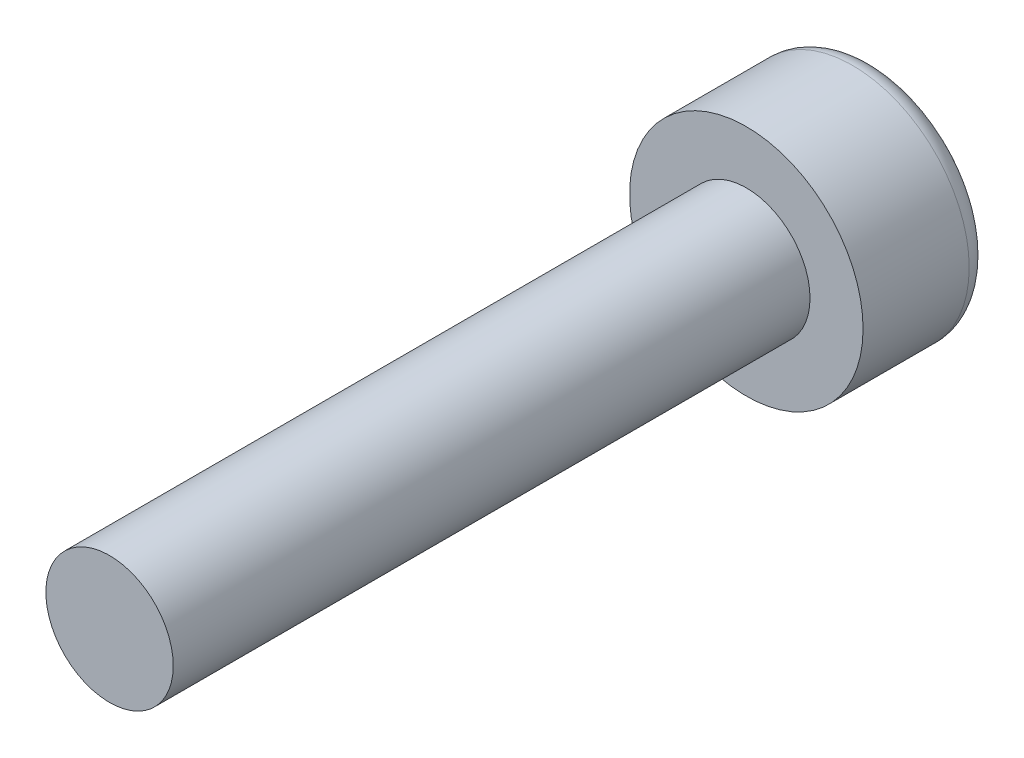
ISO-10303-21;
HEADER;
FILE_DESCRIPTION(('STEP AP214'),'2;1');
FILE_NAME('part.step','',(''),(''),'','','');
FILE_SCHEMA(('AUTOMOTIVE_DESIGN { 1 0 10303 214 1 1 1 1 }'));
ENDSEC;
DATA;
#1=APPLICATION_CONTEXT('core data for automotive mechanical design processes');
#2=APPLICATION_PROTOCOL_DEFINITION('international standard','automotive_design',2000,#1);
#3=PRODUCT_CONTEXT('',#1,'mechanical');
#4=PRODUCT('Part','Part','',(#3));
#5=PRODUCT_RELATED_PRODUCT_CATEGORY('part','',(#4));
#6=PRODUCT_DEFINITION_FORMATION('','',#4);
#7=PRODUCT_DEFINITION_CONTEXT('part definition',#1,'design');
#8=PRODUCT_DEFINITION('design','',#6,#7);
#9=PRODUCT_DEFINITION_SHAPE('','',#8);
#10=(LENGTH_UNIT() NAMED_UNIT(*) SI_UNIT(.MILLI.,.METRE.));
#11=(NAMED_UNIT(*) PLANE_ANGLE_UNIT() SI_UNIT($,.RADIAN.));
#12=(NAMED_UNIT(*) SI_UNIT($,.STERADIAN.) SOLID_ANGLE_UNIT());
#13=UNCERTAINTY_MEASURE_WITH_UNIT(LENGTH_MEASURE(1.E-05),#10,'distance_accuracy_value','');
#14=(GEOMETRIC_REPRESENTATION_CONTEXT(3) GLOBAL_UNCERTAINTY_ASSIGNED_CONTEXT((#13)) GLOBAL_UNIT_ASSIGNED_CONTEXT((#10,
#11,#12)) REPRESENTATION_CONTEXT('',''));
#15=CARTESIAN_POINT('',(0.,0.,0.));
#16=DIRECTION('',(0.,0.,1.));
#17=DIRECTION('',(1.,0.,0.));
#18=AXIS2_PLACEMENT_3D('',#15,#16,#17);
#19=CARTESIAN_POINT('',(0.,0.,3.));
#20=DIRECTION('',(0.,0.,-1.));
#21=DIRECTION('',(-1.,0.,0.));
#22=AXIS2_PLACEMENT_3D('',#19,#20,#21);
#23=CYLINDRICAL_SURFACE('',#22,2.75);
#24=CARTESIAN_POINT('',(0.,0.,0.5));
#25=DIRECTION('',(0.,0.,1.));
#26=DIRECTION('',(1.,0.,0.));
#27=AXIS2_PLACEMENT_3D('',#24,#25,#26);
#28=CIRCLE('',#27,2.75);
#29=CARTESIAN_POINT('',(2.75,0.,0.5));
#30=VERTEX_POINT('',#29);
#31=EDGE_CURVE('E39',#30,#30,#28,.T.);
#32=ORIENTED_EDGE('',*,*,#31,.T.);
#33=EDGE_LOOP('',(#32));
#34=FACE_BOUND('',#33,.T.);
#35=CARTESIAN_POINT('',(0.,0.,3.));
#36=DIRECTION('',(0.,0.,1.));
#37=DIRECTION('',(1.,0.,0.));
#38=AXIS2_PLACEMENT_3D('',#35,#36,#37);
#39=CIRCLE('',#38,2.75);
#40=CARTESIAN_POINT('',(2.75,0.,3.));
#41=VERTEX_POINT('',#40);
#42=EDGE_CURVE('E47',#41,#41,#39,.T.);
#43=ORIENTED_EDGE('',*,*,#42,.F.);
#44=EDGE_LOOP('',(#43));
#45=FACE_BOUND('',#44,.T.);
#46=ADVANCED_FACE('F32',(#34,#45),#23,.T.);
#47=CARTESIAN_POINT('',(0.,0.,3.));
#48=DIRECTION('',(0.,0.,1.));
#49=DIRECTION('',(1.,0.,0.));
#50=AXIS2_PLACEMENT_3D('',#47,#48,#49);
#51=PLANE('',#50);
#52=CARTESIAN_POINT('',(0.,0.,3.));
#53=DIRECTION('',(0.,0.,1.));
#54=DIRECTION('',(1.,0.,0.));
#55=AXIS2_PLACEMENT_3D('',#52,#53,#54);
#56=CIRCLE('',#55,1.5);
#57=CARTESIAN_POINT('',(1.5,0.,3.));
#58=VERTEX_POINT('',#57);
#59=EDGE_CURVE('E43',#58,#58,#56,.T.);
#60=ORIENTED_EDGE('',*,*,#59,.F.);
#61=EDGE_LOOP('',(#60));
#62=FACE_BOUND('',#61,.T.);
#63=ORIENTED_EDGE('',*,*,#42,.T.);
#64=EDGE_LOOP('',(#63));
#65=FACE_BOUND('',#64,.T.);
#66=ADVANCED_FACE('F65',(#62,#65),#51,.T.);
#67=CARTESIAN_POINT('',(0.,0.,0.));
#68=DIRECTION('',(0.,0.,1.));
#69=DIRECTION('',(1.,0.,0.));
#70=AXIS2_PLACEMENT_3D('',#67,#68,#69);
#71=PLANE('',#70);
#72=CARTESIAN_POINT('',(0.,0.,0.));
#73=DIRECTION('',(0.,0.,1.));
#74=DIRECTION('',(1.,0.,0.));
#75=AXIS2_PLACEMENT_3D('',#72,#73,#74);
#76=CIRCLE('',#75,2.25);
#77=CARTESIAN_POINT('',(2.25,0.,0.));
#78=VERTEX_POINT('',#77);
#79=EDGE_CURVE('E10',#78,#78,#76,.F.);
#80=ORIENTED_EDGE('',*,*,#79,.T.);
#81=EDGE_LOOP('',(#80));
#82=FACE_BOUND('',#81,.T.);
#83=ADVANCED_FACE('F61',(#82),#71,.F.);
#84=CARTESIAN_POINT('',(0.,0.,18.));
#85=DIRECTION('',(0.,0.,-1.));
#86=DIRECTION('',(-1.,0.,0.));
#87=AXIS2_PLACEMENT_3D('',#84,#85,#86);
#88=CYLINDRICAL_SURFACE('',#87,1.5);
#89=CARTESIAN_POINT('',(0.,0.,18.));
#90=DIRECTION('',(0.,0.,1.));
#91=DIRECTION('',(1.,0.,0.));
#92=AXIS2_PLACEMENT_3D('',#89,#90,#91);
#93=CIRCLE('',#92,1.5);
#94=CARTESIAN_POINT('',(1.5,0.,18.));
#95=VERTEX_POINT('',#94);
#96=EDGE_CURVE('E51',#95,#95,#93,.T.);
#97=ORIENTED_EDGE('',*,*,#96,.F.);
#98=EDGE_LOOP('',(#97));
#99=FACE_BOUND('',#98,.T.);
#100=ORIENTED_EDGE('',*,*,#59,.T.);
#101=EDGE_LOOP('',(#100));
#102=FACE_BOUND('',#101,.T.);
#103=ADVANCED_FACE('F58',(#99,#102),#88,.T.);
#104=CARTESIAN_POINT('',(0.,0.,18.));
#105=DIRECTION('',(0.,0.,1.));
#106=DIRECTION('',(1.,0.,0.));
#107=AXIS2_PLACEMENT_3D('',#104,#105,#106);
#108=PLANE('',#107);
#109=ORIENTED_EDGE('',*,*,#96,.T.);
#110=EDGE_LOOP('',(#109));
#111=FACE_BOUND('',#110,.T.);
#112=ADVANCED_FACE('F56',(#111),#108,.T.);
#113=CARTESIAN_POINT('',(0.,0.,0.5));
#114=DIRECTION('',(0.,0.,1.));
#115=DIRECTION('',(1.,0.,0.));
#116=AXIS2_PLACEMENT_3D('',#113,#114,#115);
#117=TOROIDAL_SURFACE('',#116,2.25,0.5);
#118=ORIENTED_EDGE('',*,*,#79,.F.);
#119=EDGE_LOOP('',(#118));
#120=FACE_BOUND('',#119,.T.);
#121=ORIENTED_EDGE('',*,*,#31,.F.);
#122=EDGE_LOOP('',(#121));
#123=FACE_BOUND('',#122,.T.);
#124=ADVANCED_FACE('F34',(#120,#123),#117,.T.);
#125=CLOSED_SHELL('',(#46,#66,#83,#103,#112,#124));
#126=MANIFOLD_SOLID_BREP('B2',#125);
#127=ADVANCED_BREP_SHAPE_REPRESENTATION('',(#18,#126),#14);
#128=SHAPE_DEFINITION_REPRESENTATION(#9,#127);
ENDSEC;
END-ISO-10303-21;
